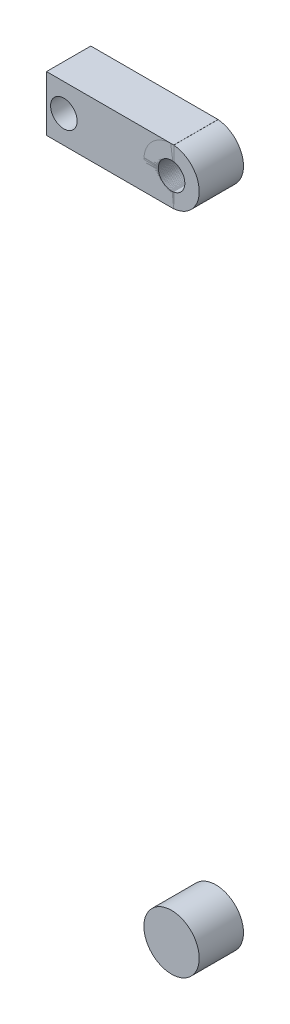
ISO-10303-21;
HEADER;
FILE_DESCRIPTION(('STEP AP214'),'2;1');
FILE_NAME('part.step','',(''),(''),'','','');
FILE_SCHEMA(('AUTOMOTIVE_DESIGN { 1 0 10303 214 1 1 1 1 }'));
ENDSEC;
DATA;
#1=APPLICATION_CONTEXT('core data for automotive mechanical design processes');
#2=APPLICATION_PROTOCOL_DEFINITION('international standard','automotive_design',2000,#1);
#3=PRODUCT_CONTEXT('',#1,'mechanical');
#4=PRODUCT('Part','Part','',(#3));
#5=PRODUCT_RELATED_PRODUCT_CATEGORY('part','',(#4));
#6=PRODUCT_DEFINITION_FORMATION('','',#4);
#7=PRODUCT_DEFINITION_CONTEXT('part definition',#1,'design');
#8=PRODUCT_DEFINITION('design','',#6,#7);
#9=PRODUCT_DEFINITION_SHAPE('','',#8);
#10=(LENGTH_UNIT() NAMED_UNIT(*) SI_UNIT(.MILLI.,.METRE.));
#11=(NAMED_UNIT(*) PLANE_ANGLE_UNIT() SI_UNIT($,.RADIAN.));
#12=(NAMED_UNIT(*) SI_UNIT($,.STERADIAN.) SOLID_ANGLE_UNIT());
#13=UNCERTAINTY_MEASURE_WITH_UNIT(LENGTH_MEASURE(1.E-05),#10,'distance_accuracy_value','');
#14=(GEOMETRIC_REPRESENTATION_CONTEXT(3) GLOBAL_UNCERTAINTY_ASSIGNED_CONTEXT((#13)) GLOBAL_UNIT_ASSIGNED_CONTEXT((#10,
#11,#12)) REPRESENTATION_CONTEXT('',''));
#15=CARTESIAN_POINT('',(0.,0.,0.));
#16=DIRECTION('',(0.,0.,1.));
#17=DIRECTION('',(1.,0.,0.));
#18=AXIS2_PLACEMENT_3D('',#15,#16,#17);
#19=CARTESIAN_POINT('',(12.5,17.4033881486713,0.));
#20=DIRECTION('',(1.,0.,0.));
#21=DIRECTION('',(0.,0.,-1.));
#22=AXIS2_PLACEMENT_3D('',#19,#20,#21);
#23=PLANE('',#22);
#24=DIRECTION('',(0.,0.,1.));
#25=VECTOR('',#24,1.);
#26=CARTESIAN_POINT('',(12.5,10.8191500021154,-25.));
#27=LINE('',#26,#25);
#28=CARTESIAN_POINT('',(12.5,10.8191500021154,0.));
#29=VERTEX_POINT('',#28);
#30=CARTESIAN_POINT('',(12.5,10.8191500021154,20.));
#31=VERTEX_POINT('',#30);
#32=EDGE_CURVE('E12',#29,#31,#27,.T.);
#33=ORIENTED_EDGE('',*,*,#32,.F.);
#34=DIRECTION('',(0.,1.,0.));
#35=VECTOR('',#34,1.);
#36=CARTESIAN_POINT('',(12.5,-7.59661185132871,0.));
#37=LINE('',#36,#35);
#38=CARTESIAN_POINT('',(12.5,17.4033881486713,0.));
#39=VERTEX_POINT('',#38);
#40=EDGE_CURVE('E125',#29,#39,#37,.T.);
#41=ORIENTED_EDGE('',*,*,#40,.T.);
#42=DIRECTION('',(0.,0.,1.));
#43=VECTOR('',#42,1.);
#44=CARTESIAN_POINT('',(12.5,17.4033881486713,0.));
#45=LINE('',#44,#43);
#46=CARTESIAN_POINT('',(12.5,17.4033881486713,20.));
#47=VERTEX_POINT('',#46);
#48=EDGE_CURVE('E107',#39,#47,#45,.T.);
#49=ORIENTED_EDGE('',*,*,#48,.T.);
#50=DIRECTION('',(0.,-1.,0.));
#51=VECTOR('',#50,1.);
#52=CARTESIAN_POINT('',(12.5,-7.59661185132871,20.));
#53=LINE('',#52,#51);
#54=EDGE_CURVE('E101',#47,#31,#53,.T.);
#55=ORIENTED_EDGE('',*,*,#54,.T.);
#56=EDGE_LOOP('',(#33,#41,#49,#55));
#57=FACE_BOUND('',#56,.T.);
#58=ADVANCED_FACE('F40',(#57),#23,.T.);
#59=CARTESIAN_POINT('',(12.5,-7.59661185132871,0.));
#60=DIRECTION('',(0.,0.,1.));
#61=DIRECTION('',(1.,0.,0.));
#62=AXIS2_PLACEMENT_3D('',#59,#60,#61);
#63=PLANE('',#62);
#64=CARTESIAN_POINT('',(-37.1655921426554,4.90338814867129,0.));
#65=DIRECTION('',(0.,0.,1.));
#66=DIRECTION('',(1.,0.,0.));
#67=AXIS2_PLACEMENT_3D('',#64,#65,#66);
#68=CIRCLE('',#67,6.);
#69=CARTESIAN_POINT('',(-31.1655921426554,4.90338814867129,0.));
#70=VERTEX_POINT('',#69);
#71=EDGE_CURVE('E126',#70,#70,#68,.T.);
#72=ORIENTED_EDGE('',*,*,#71,.T.);
#73=EDGE_LOOP('',(#72));
#74=FACE_BOUND('',#73,.T.);
#75=ORIENTED_EDGE('',*,*,#40,.F.);
#76=CARTESIAN_POINT('',(11.4981209188054,4.90338814867129,0.));
#77=DIRECTION('',(0.,0.,1.));
#78=DIRECTION('',(1.,0.,0.));
#79=AXIS2_PLACEMENT_3D('',#76,#77,#78);
#80=CIRCLE('',#79,6.);
#81=CARTESIAN_POINT('',(12.5,-1.01237370477283,0.));
#82=VERTEX_POINT('',#81);
#83=EDGE_CURVE('E93',#29,#82,#80,.T.);
#84=ORIENTED_EDGE('',*,*,#83,.T.);
#85=CARTESIAN_POINT('',(12.5,-7.59661185132871,0.));
#86=VERTEX_POINT('',#85);
#87=EDGE_CURVE('E123',#86,#82,#37,.T.);
#88=ORIENTED_EDGE('',*,*,#87,.F.);
#89=DIRECTION('',(-1.,0.,0.));
#90=VECTOR('',#89,1.);
#91=CARTESIAN_POINT('',(12.5,-7.59661185132871,0.));
#92=LINE('',#91,#90);
#93=CARTESIAN_POINT('',(-45.,-7.59661185132871,0.));
#94=VERTEX_POINT('',#93);
#95=EDGE_CURVE('E110',#86,#94,#92,.T.);
#96=ORIENTED_EDGE('',*,*,#95,.T.);
#97=DIRECTION('',(0.,1.,0.));
#98=VECTOR('',#97,1.);
#99=CARTESIAN_POINT('',(-45.,-7.59661185132871,0.));
#100=LINE('',#99,#98);
#101=CARTESIAN_POINT('',(-45.,17.4033881486713,0.));
#102=VERTEX_POINT('',#101);
#103=EDGE_CURVE('E139',#94,#102,#100,.T.);
#104=ORIENTED_EDGE('',*,*,#103,.T.);
#105=DIRECTION('',(-1.,0.,0.));
#106=VECTOR('',#105,1.);
#107=CARTESIAN_POINT('',(12.5,17.4033881486713,0.));
#108=LINE('',#107,#106);
#109=EDGE_CURVE('E120',#39,#102,#108,.T.);
#110=ORIENTED_EDGE('',*,*,#109,.F.);
#111=EDGE_LOOP('',(#75,#84,#88,#96,#104,#110));
#112=FACE_BOUND('',#111,.T.);
#113=ADVANCED_FACE('F42',(#74,#112),#63,.F.);
#114=CARTESIAN_POINT('',(12.5,17.4033881486713,0.));
#115=DIRECTION('',(0.,-1.,0.));
#116=DIRECTION('',(0.,0.,-1.));
#117=AXIS2_PLACEMENT_3D('',#114,#115,#116);
#118=PLANE('',#117);
#119=ORIENTED_EDGE('',*,*,#109,.T.);
#120=DIRECTION('',(0.,0.,1.));
#121=VECTOR('',#120,1.);
#122=CARTESIAN_POINT('',(-45.,17.4033881486713,0.));
#123=LINE('',#122,#121);
#124=CARTESIAN_POINT('',(-45.,17.4033881486713,20.));
#125=VERTEX_POINT('',#124);
#126=EDGE_CURVE('E136',#102,#125,#123,.T.);
#127=ORIENTED_EDGE('',*,*,#126,.T.);
#128=DIRECTION('',(-1.,0.,0.));
#129=VECTOR('',#128,1.);
#130=CARTESIAN_POINT('',(12.5,17.4033881486713,20.));
#131=LINE('',#130,#129);
#132=EDGE_CURVE('E118',#47,#125,#131,.T.);
#133=ORIENTED_EDGE('',*,*,#132,.F.);
#134=ORIENTED_EDGE('',*,*,#48,.F.);
#135=EDGE_LOOP('',(#119,#127,#133,#134));
#136=FACE_BOUND('',#135,.T.);
#137=ADVANCED_FACE('F152',(#136),#118,.F.);
#138=CARTESIAN_POINT('',(12.5,-7.59661185132871,20.));
#139=DIRECTION('',(0.,0.,-1.));
#140=DIRECTION('',(-1.,0.,0.));
#141=AXIS2_PLACEMENT_3D('',#138,#139,#140);
#142=PLANE('',#141);
#143=CARTESIAN_POINT('',(-37.1655921426554,4.90338814867129,20.));
#144=DIRECTION('',(0.,0.,1.));
#145=DIRECTION('',(1.,0.,0.));
#146=AXIS2_PLACEMENT_3D('',#143,#144,#145);
#147=CIRCLE('',#146,6.);
#148=CARTESIAN_POINT('',(-31.1655921426554,4.90338814867129,20.));
#149=VERTEX_POINT('',#148);
#150=EDGE_CURVE('E104',#149,#149,#147,.T.);
#151=ORIENTED_EDGE('',*,*,#150,.F.);
#152=EDGE_LOOP('',(#151));
#153=FACE_BOUND('',#152,.T.);
#154=CARTESIAN_POINT('',(12.5,-1.01237370477283,20.));
#155=VERTEX_POINT('',#154);
#156=CARTESIAN_POINT('',(12.5,-7.59661185132871,20.));
#157=VERTEX_POINT('',#156);
#158=EDGE_CURVE('E103',#155,#157,#53,.T.);
#159=ORIENTED_EDGE('',*,*,#158,.F.);
#160=CARTESIAN_POINT('',(11.4981209188054,4.90338814867129,20.));
#161=DIRECTION('',(0.,0.,1.));
#162=DIRECTION('',(1.,0.,0.));
#163=AXIS2_PLACEMENT_3D('',#160,#161,#162);
#164=CIRCLE('',#163,6.);
#165=EDGE_CURVE('E54',#31,#155,#164,.T.);
#166=ORIENTED_EDGE('',*,*,#165,.F.);
#167=ORIENTED_EDGE('',*,*,#54,.F.);
#168=ORIENTED_EDGE('',*,*,#132,.T.);
#169=DIRECTION('',(0.,-1.,0.));
#170=VECTOR('',#169,1.);
#171=CARTESIAN_POINT('',(-45.,-7.59661185132871,20.));
#172=LINE('',#171,#170);
#173=CARTESIAN_POINT('',(-45.,-7.59661185132871,20.));
#174=VERTEX_POINT('',#173);
#175=EDGE_CURVE('E133',#125,#174,#172,.T.);
#176=ORIENTED_EDGE('',*,*,#175,.T.);
#177=DIRECTION('',(-1.,0.,0.));
#178=VECTOR('',#177,1.);
#179=CARTESIAN_POINT('',(12.5,-7.59661185132871,20.));
#180=LINE('',#179,#178);
#181=EDGE_CURVE('E116',#157,#174,#180,.T.);
#182=ORIENTED_EDGE('',*,*,#181,.F.);
#183=EDGE_LOOP('',(#159,#166,#167,#168,#176,#182));
#184=FACE_BOUND('',#183,.T.);
#185=ADVANCED_FACE('F100',(#153,#184),#142,.F.);
#186=CARTESIAN_POINT('',(12.5,-7.59661185132871,0.));
#187=DIRECTION('',(0.,1.,0.));
#188=DIRECTION('',(0.,0.,1.));
#189=AXIS2_PLACEMENT_3D('',#186,#187,#188);
#190=PLANE('',#189);
#191=ORIENTED_EDGE('',*,*,#181,.T.);
#192=DIRECTION('',(0.,0.,-1.));
#193=VECTOR('',#192,1.);
#194=CARTESIAN_POINT('',(-45.,-7.59661185132871,0.));
#195=LINE('',#194,#193);
#196=EDGE_CURVE('E129',#174,#94,#195,.T.);
#197=ORIENTED_EDGE('',*,*,#196,.T.);
#198=ORIENTED_EDGE('',*,*,#95,.F.);
#199=DIRECTION('',(0.,0.,-1.));
#200=VECTOR('',#199,1.);
#201=CARTESIAN_POINT('',(12.5,-7.59661185132871,0.));
#202=LINE('',#201,#200);
#203=EDGE_CURVE('E62',#157,#86,#202,.T.);
#204=ORIENTED_EDGE('',*,*,#203,.F.);
#205=EDGE_LOOP('',(#191,#197,#198,#204));
#206=FACE_BOUND('',#205,.T.);
#207=ADVANCED_FACE('F151',(#206),#190,.F.);
#208=DIRECTION('',(0.,0.,1.));
#209=VECTOR('',#208,1.);
#210=CARTESIAN_POINT('',(12.5,-1.01237370477283,-25.));
#211=LINE('',#210,#209);
#212=EDGE_CURVE('E48',#155,#82,#211,.F.);
#213=ORIENTED_EDGE('',*,*,#212,.F.);
#214=ORIENTED_EDGE('',*,*,#158,.T.);
#215=ORIENTED_EDGE('',*,*,#203,.T.);
#216=ORIENTED_EDGE('',*,*,#87,.T.);
#217=EDGE_LOOP('',(#213,#214,#215,#216));
#218=FACE_BOUND('',#217,.T.);
#219=ADVANCED_FACE('F128',(#218),#23,.T.);
#220=CARTESIAN_POINT('',(-45.,17.4033881486713,0.));
#221=DIRECTION('',(1.,0.,0.));
#222=DIRECTION('',(0.,0.,-1.));
#223=AXIS2_PLACEMENT_3D('',#220,#221,#222);
#224=PLANE('',#223);
#225=ORIENTED_EDGE('',*,*,#103,.F.);
#226=ORIENTED_EDGE('',*,*,#196,.F.);
#227=ORIENTED_EDGE('',*,*,#175,.F.);
#228=ORIENTED_EDGE('',*,*,#126,.F.);
#229=EDGE_LOOP('',(#225,#226,#227,#228));
#230=FACE_BOUND('',#229,.T.);
#231=ADVANCED_FACE('F169',(#230),#224,.F.);
#232=CARTESIAN_POINT('',(11.4981209188054,4.90338814867129,-25.));
#233=DIRECTION('',(0.,0.,1.));
#234=DIRECTION('',(1.,0.,0.));
#235=AXIS2_PLACEMENT_3D('',#232,#233,#234);
#236=CYLINDRICAL_SURFACE('',#235,6.);
#237=ORIENTED_EDGE('',*,*,#32,.T.);
#238=ORIENTED_EDGE('',*,*,#165,.T.);
#239=ORIENTED_EDGE('',*,*,#212,.T.);
#240=ORIENTED_EDGE('',*,*,#83,.F.);
#241=EDGE_LOOP('',(#237,#238,#239,#240));
#242=FACE_BOUND('',#241,.T.);
#243=ADVANCED_FACE('F91',(#242),#236,.F.);
#244=CARTESIAN_POINT('',(-37.1655921426554,4.90338814867129,-25.));
#245=DIRECTION('',(0.,0.,1.));
#246=DIRECTION('',(1.,0.,0.));
#247=AXIS2_PLACEMENT_3D('',#244,#245,#246);
#248=CYLINDRICAL_SURFACE('',#247,6.);
#249=ORIENTED_EDGE('',*,*,#150,.T.);
#250=EDGE_LOOP('',(#249));
#251=FACE_BOUND('',#250,.T.);
#252=ORIENTED_EDGE('',*,*,#71,.F.);
#253=EDGE_LOOP('',(#252));
#254=FACE_BOUND('',#253,.T.);
#255=ADVANCED_FACE('F147',(#251,#254),#248,.F.);
#256=CLOSED_SHELL('',(#58,#113,#137,#185,#207,#219,#231,#243,#255));
#257=MANIFOLD_SOLID_BREP('B2',#256);
#258=CARTESIAN_POINT('',(11.4981209188054,-295.096611851329,20.));
#259=DIRECTION('',(0.,0.,-1.));
#260=DIRECTION('',(-1.,0.,0.));
#261=AXIS2_PLACEMENT_3D('',#258,#259,#260);
#262=CYLINDRICAL_SURFACE('',#261,12.5);
#263=CARTESIAN_POINT('',(11.4981209188054,-295.096611851329,20.));
#264=DIRECTION('',(0.,0.,1.));
#265=DIRECTION('',(1.,0.,0.));
#266=AXIS2_PLACEMENT_3D('',#263,#264,#265);
#267=CIRCLE('',#266,12.5);
#268=CARTESIAN_POINT('',(23.9981209188054,-295.096611851329,20.));
#269=VERTEX_POINT('',#268);
#270=EDGE_CURVE('E39',#269,#269,#267,.T.);
#271=ORIENTED_EDGE('',*,*,#270,.F.);
#272=EDGE_LOOP('',(#271));
#273=FACE_BOUND('',#272,.T.);
#274=CARTESIAN_POINT('',(11.4981209188054,-295.096611851329,0.));
#275=DIRECTION('',(0.,0.,1.));
#276=DIRECTION('',(1.,0.,0.));
#277=AXIS2_PLACEMENT_3D('',#274,#275,#276);
#278=CIRCLE('',#277,12.5);
#279=CARTESIAN_POINT('',(23.9981209188054,-295.096611851329,0.));
#280=VERTEX_POINT('',#279);
#281=EDGE_CURVE('E244',#280,#280,#278,.T.);
#282=ORIENTED_EDGE('',*,*,#281,.T.);
#283=EDGE_LOOP('',(#282));
#284=FACE_BOUND('',#283,.T.);
#285=ADVANCED_FACE('F241',(#273,#284),#262,.T.);
#286=CARTESIAN_POINT('',(11.4981209188054,-295.096611851329,20.));
#287=DIRECTION('',(0.,0.,1.));
#288=DIRECTION('',(1.,0.,0.));
#289=AXIS2_PLACEMENT_3D('',#286,#287,#288);
#290=PLANE('',#289);
#291=ORIENTED_EDGE('',*,*,#270,.T.);
#292=EDGE_LOOP('',(#291));
#293=FACE_BOUND('',#292,.T.);
#294=ADVANCED_FACE('F256',(#293),#290,.T.);
#295=CARTESIAN_POINT('',(11.4981209188054,-295.096611851329,0.));
#296=DIRECTION('',(0.,0.,1.));
#297=DIRECTION('',(1.,0.,0.));
#298=AXIS2_PLACEMENT_3D('',#295,#296,#297);
#299=PLANE('',#298);
#300=ORIENTED_EDGE('',*,*,#281,.F.);
#301=EDGE_LOOP('',(#300));
#302=FACE_BOUND('',#301,.T.);
#303=ADVANCED_FACE('F254',(#302),#299,.F.);
#304=CLOSED_SHELL('',(#285,#294,#303));
#305=MANIFOLD_SOLID_BREP('B6',#304);
#306=CARTESIAN_POINT('',(11.4981209188054,4.90338814867129,20.));
#307=DIRECTION('',(0.,0.,-1.));
#308=DIRECTION('',(-1.,0.,0.));
#309=AXIS2_PLACEMENT_3D('',#306,#307,#308);
#310=CYLINDRICAL_SURFACE('',#309,12.5);
#311=CARTESIAN_POINT('',(11.4981209188054,4.90338814867129,20.));
#312=DIRECTION('',(0.,0.,1.));
#313=DIRECTION('',(1.,0.,0.));
#314=AXIS2_PLACEMENT_3D('',#311,#312,#313);
#315=CIRCLE('',#314,12.5);
#316=CARTESIAN_POINT('',(23.9981209188054,4.90338814867129,20.));
#317=VERTEX_POINT('',#316);
#318=EDGE_CURVE('E240',#317,#317,#315,.T.);
#319=ORIENTED_EDGE('',*,*,#318,.F.);
#320=EDGE_LOOP('',(#319));
#321=FACE_BOUND('',#320,.T.);
#322=CARTESIAN_POINT('',(11.4981209188054,4.90338814867129,0.));
#323=DIRECTION('',(0.,0.,1.));
#324=DIRECTION('',(1.,0.,0.));
#325=AXIS2_PLACEMENT_3D('',#322,#323,#324);
#326=CIRCLE('',#325,12.5);
#327=CARTESIAN_POINT('',(23.9981209188054,4.90338814867129,0.));
#328=VERTEX_POINT('',#327);
#329=EDGE_CURVE('E289',#328,#328,#326,.T.);
#330=ORIENTED_EDGE('',*,*,#329,.T.);
#331=EDGE_LOOP('',(#330));
#332=FACE_BOUND('',#331,.T.);
#333=ADVANCED_FACE('F282',(#321,#332),#310,.T.);
#334=CARTESIAN_POINT('',(11.4981209188054,4.90338814867129,20.));
#335=DIRECTION('',(0.,0.,1.));
#336=DIRECTION('',(1.,0.,0.));
#337=AXIS2_PLACEMENT_3D('',#334,#335,#336);
#338=PLANE('',#337);
#339=CARTESIAN_POINT('',(11.4981209188054,4.90338814867129,20.));
#340=DIRECTION('',(0.,0.,1.));
#341=DIRECTION('',(1.,0.,0.));
#342=AXIS2_PLACEMENT_3D('',#339,#340,#341);
#343=CIRCLE('',#342,6.);
#344=CARTESIAN_POINT('',(17.4981209188054,4.90338814867129,20.));
#345=VERTEX_POINT('',#344);
#346=EDGE_CURVE('E295',#345,#345,#343,.T.);
#347=ORIENTED_EDGE('',*,*,#346,.F.);
#348=EDGE_LOOP('',(#347));
#349=FACE_BOUND('',#348,.T.);
#350=ORIENTED_EDGE('',*,*,#318,.T.);
#351=EDGE_LOOP('',(#350));
#352=FACE_BOUND('',#351,.T.);
#353=ADVANCED_FACE('F311',(#349,#352),#338,.T.);
#354=CARTESIAN_POINT('',(11.4981209188054,4.90338814867129,0.));
#355=DIRECTION('',(0.,0.,1.));
#356=DIRECTION('',(1.,0.,0.));
#357=AXIS2_PLACEMENT_3D('',#354,#355,#356);
#358=PLANE('',#357);
#359=CARTESIAN_POINT('',(11.4981209188054,4.90338814867129,0.));
#360=DIRECTION('',(0.,0.,1.));
#361=DIRECTION('',(1.,0.,0.));
#362=AXIS2_PLACEMENT_3D('',#359,#360,#361);
#363=CIRCLE('',#362,6.);
#364=CARTESIAN_POINT('',(17.4981209188054,4.90338814867129,0.));
#365=VERTEX_POINT('',#364);
#366=EDGE_CURVE('E285',#365,#365,#363,.T.);
#367=ORIENTED_EDGE('',*,*,#366,.T.);
#368=EDGE_LOOP('',(#367));
#369=FACE_BOUND('',#368,.T.);
#370=ORIENTED_EDGE('',*,*,#329,.F.);
#371=EDGE_LOOP('',(#370));
#372=FACE_BOUND('',#371,.T.);
#373=ADVANCED_FACE('F302',(#369,#372),#358,.F.);
#374=CARTESIAN_POINT('',(11.4981209188054,4.90338814867129,-25.));
#375=DIRECTION('',(0.,0.,1.));
#376=DIRECTION('',(1.,0.,0.));
#377=AXIS2_PLACEMENT_3D('',#374,#375,#376);
#378=CYLINDRICAL_SURFACE('',#377,6.);
#379=ORIENTED_EDGE('',*,*,#346,.T.);
#380=EDGE_LOOP('',(#379));
#381=FACE_BOUND('',#380,.T.);
#382=ORIENTED_EDGE('',*,*,#366,.F.);
#383=EDGE_LOOP('',(#382));
#384=FACE_BOUND('',#383,.T.);
#385=ADVANCED_FACE('F305',(#381,#384),#378,.F.);
#386=CLOSED_SHELL('',(#333,#353,#373,#385));
#387=MANIFOLD_SOLID_BREP('B34',#386);
#388=ADVANCED_BREP_SHAPE_REPRESENTATION('',(#18,#257,#305,#387),#14);
#389=SHAPE_DEFINITION_REPRESENTATION(#9,#388);
ENDSEC;
END-ISO-10303-21;
